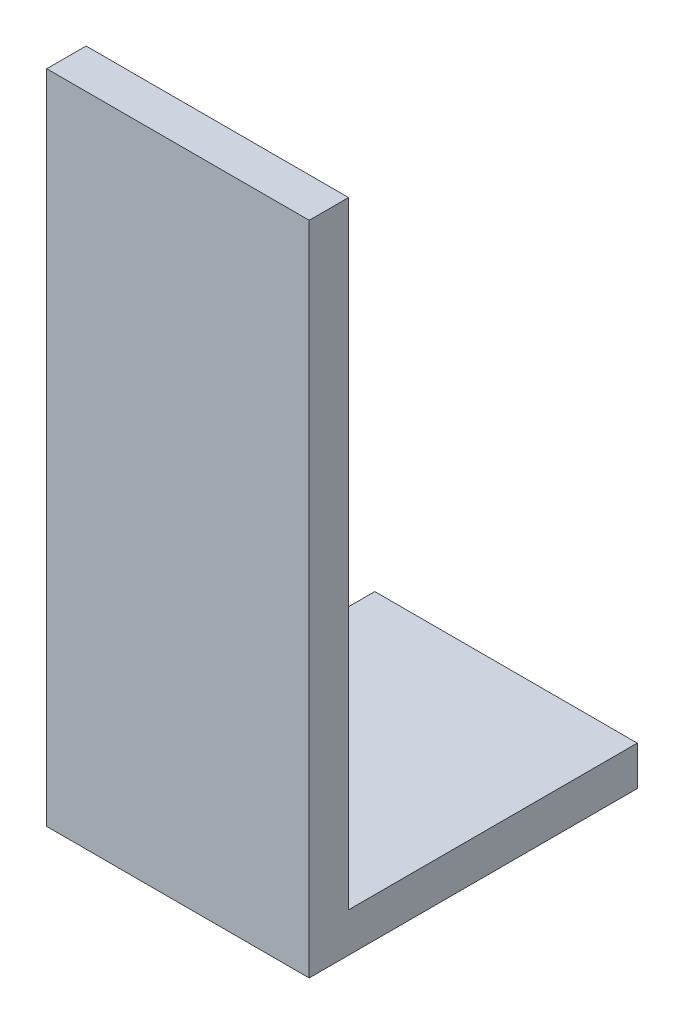
ISO-10303-21;
HEADER;
FILE_DESCRIPTION(('STEP AP214'),'2;1');
FILE_NAME('part.step','',(''),(''),'','','');
FILE_SCHEMA(('AUTOMOTIVE_DESIGN { 1 0 10303 214 1 1 1 1 }'));
ENDSEC;
DATA;
#1=APPLICATION_CONTEXT('core data for automotive mechanical design processes');
#2=APPLICATION_PROTOCOL_DEFINITION('international standard','automotive_design',2000,#1);
#3=PRODUCT_CONTEXT('',#1,'mechanical');
#4=PRODUCT('Part','Part','',(#3));
#5=PRODUCT_RELATED_PRODUCT_CATEGORY('part','',(#4));
#6=PRODUCT_DEFINITION_FORMATION('','',#4);
#7=PRODUCT_DEFINITION_CONTEXT('part definition',#1,'design');
#8=PRODUCT_DEFINITION('design','',#6,#7);
#9=PRODUCT_DEFINITION_SHAPE('','',#8);
#10=(LENGTH_UNIT() NAMED_UNIT(*) SI_UNIT(.MILLI.,.METRE.));
#11=(NAMED_UNIT(*) PLANE_ANGLE_UNIT() SI_UNIT($,.RADIAN.));
#12=(NAMED_UNIT(*) SI_UNIT($,.STERADIAN.) SOLID_ANGLE_UNIT());
#13=UNCERTAINTY_MEASURE_WITH_UNIT(LENGTH_MEASURE(1.E-05),#10,'distance_accuracy_value','');
#14=(GEOMETRIC_REPRESENTATION_CONTEXT(3) GLOBAL_UNCERTAINTY_ASSIGNED_CONTEXT((#13)) GLOBAL_UNIT_ASSIGNED_CONTEXT((#10,
#11,#12)) REPRESENTATION_CONTEXT('',''));
#15=CARTESIAN_POINT('',(0.,0.,0.));
#16=DIRECTION('',(0.,0.,1.));
#17=DIRECTION('',(1.,0.,0.));
#18=AXIS2_PLACEMENT_3D('',#15,#16,#17);
#19=CARTESIAN_POINT('',(20.,0.,0.));
#20=DIRECTION('',(0.,0.,-1.));
#21=DIRECTION('',(0.,1.,0.));
#22=AXIS2_PLACEMENT_3D('',#19,#20,#21);
#23=PLANE('',#22);
#24=DIRECTION('',(0.,-1.,0.));
#25=VECTOR('',#24,1.);
#26=CARTESIAN_POINT('',(0.,0.,0.));
#27=LINE('',#26,#25);
#28=CARTESIAN_POINT('',(0.,50.,0.));
#29=VERTEX_POINT('',#28);
#30=CARTESIAN_POINT('',(0.,0.,0.));
#31=VERTEX_POINT('',#30);
#32=EDGE_CURVE('E121',#29,#31,#27,.T.);
#33=ORIENTED_EDGE('',*,*,#32,.T.);
#34=DIRECTION('',(-1.,0.,0.));
#35=VECTOR('',#34,1.);
#36=CARTESIAN_POINT('',(20.,0.,0.));
#37=LINE('',#36,#35);
#38=CARTESIAN_POINT('',(20.,0.,0.));
#39=VERTEX_POINT('',#38);
#40=EDGE_CURVE('E11',#39,#31,#37,.T.);
#41=ORIENTED_EDGE('',*,*,#40,.F.);
#42=DIRECTION('',(0.,-1.,0.));
#43=VECTOR('',#42,1.);
#44=CARTESIAN_POINT('',(20.,0.,0.));
#45=LINE('',#44,#43);
#46=CARTESIAN_POINT('',(20.,50.,0.));
#47=VERTEX_POINT('',#46);
#48=EDGE_CURVE('E134',#47,#39,#45,.T.);
#49=ORIENTED_EDGE('',*,*,#48,.F.);
#50=DIRECTION('',(-1.,0.,0.));
#51=VECTOR('',#50,1.);
#52=CARTESIAN_POINT('',(20.,50.,0.));
#53=LINE('',#52,#51);
#54=EDGE_CURVE('E53',#47,#29,#53,.T.);
#55=ORIENTED_EDGE('',*,*,#54,.T.);
#56=EDGE_LOOP('',(#33,#41,#49,#55));
#57=FACE_BOUND('',#56,.T.);
#58=ADVANCED_FACE('F37',(#57),#23,.F.);
#59=CARTESIAN_POINT('',(20.,0.,0.));
#60=DIRECTION('',(0.,1.,0.));
#61=DIRECTION('',(0.,0.,1.));
#62=AXIS2_PLACEMENT_3D('',#59,#60,#61);
#63=PLANE('',#62);
#64=DIRECTION('',(0.,0.,-1.));
#65=VECTOR('',#64,1.);
#66=CARTESIAN_POINT('',(0.,0.,0.));
#67=LINE('',#66,#65);
#68=CARTESIAN_POINT('',(0.,0.,-25.));
#69=VERTEX_POINT('',#68);
#70=EDGE_CURVE('E123',#31,#69,#67,.T.);
#71=ORIENTED_EDGE('',*,*,#70,.T.);
#72=DIRECTION('',(-1.,0.,0.));
#73=VECTOR('',#72,1.);
#74=CARTESIAN_POINT('',(20.,0.,-25.));
#75=LINE('',#74,#73);
#76=CARTESIAN_POINT('',(20.,0.,-25.));
#77=VERTEX_POINT('',#76);
#78=EDGE_CURVE('E45',#77,#69,#75,.T.);
#79=ORIENTED_EDGE('',*,*,#78,.F.);
#80=DIRECTION('',(0.,0.,-1.));
#81=VECTOR('',#80,1.);
#82=CARTESIAN_POINT('',(20.,0.,0.));
#83=LINE('',#82,#81);
#84=EDGE_CURVE('E85',#39,#77,#83,.T.);
#85=ORIENTED_EDGE('',*,*,#84,.F.);
#86=ORIENTED_EDGE('',*,*,#40,.T.);
#87=EDGE_LOOP('',(#71,#79,#85,#86));
#88=FACE_BOUND('',#87,.T.);
#89=ADVANCED_FACE('F154',(#88),#63,.F.);
#90=CARTESIAN_POINT('',(20.,0.,-25.));
#91=DIRECTION('',(0.,0.,1.));
#92=DIRECTION('',(1.,0.,0.));
#93=AXIS2_PLACEMENT_3D('',#90,#91,#92);
#94=PLANE('',#93);
#95=DIRECTION('',(0.,1.,0.));
#96=VECTOR('',#95,1.);
#97=CARTESIAN_POINT('',(0.,0.,-25.));
#98=LINE('',#97,#96);
#99=CARTESIAN_POINT('',(0.,3.,-25.));
#100=VERTEX_POINT('',#99);
#101=EDGE_CURVE('E125',#69,#100,#98,.T.);
#102=ORIENTED_EDGE('',*,*,#101,.T.);
#103=DIRECTION('',(-1.,0.,0.));
#104=VECTOR('',#103,1.);
#105=CARTESIAN_POINT('',(20.,3.,-25.));
#106=LINE('',#105,#104);
#107=CARTESIAN_POINT('',(20.,3.,-25.));
#108=VERTEX_POINT('',#107);
#109=EDGE_CURVE('E104',#108,#100,#106,.T.);
#110=ORIENTED_EDGE('',*,*,#109,.F.);
#111=DIRECTION('',(0.,1.,0.));
#112=VECTOR('',#111,1.);
#113=CARTESIAN_POINT('',(20.,0.,-25.));
#114=LINE('',#113,#112);
#115=EDGE_CURVE('E112',#77,#108,#114,.T.);
#116=ORIENTED_EDGE('',*,*,#115,.F.);
#117=ORIENTED_EDGE('',*,*,#78,.T.);
#118=EDGE_LOOP('',(#102,#110,#116,#117));
#119=FACE_BOUND('',#118,.T.);
#120=ADVANCED_FACE('F140',(#119),#94,.F.);
#121=CARTESIAN_POINT('',(20.,3.,0.));
#122=DIRECTION('',(0.,1.,0.));
#123=DIRECTION('',(0.,0.,1.));
#124=AXIS2_PLACEMENT_3D('',#121,#122,#123);
#125=PLANE('',#124);
#126=DIRECTION('',(0.,0.,-1.));
#127=VECTOR('',#126,1.);
#128=CARTESIAN_POINT('',(0.,3.,0.));
#129=LINE('',#128,#127);
#130=CARTESIAN_POINT('',(0.,3.,-3.));
#131=VERTEX_POINT('',#130);
#132=EDGE_CURVE('E100',#131,#100,#129,.T.);
#133=ORIENTED_EDGE('',*,*,#132,.F.);
#134=DIRECTION('',(-1.,0.,0.));
#135=VECTOR('',#134,1.);
#136=CARTESIAN_POINT('',(20.,3.,-3.));
#137=LINE('',#136,#135);
#138=CARTESIAN_POINT('',(20.,3.,-3.));
#139=VERTEX_POINT('',#138);
#140=EDGE_CURVE('E95',#139,#131,#137,.T.);
#141=ORIENTED_EDGE('',*,*,#140,.F.);
#142=DIRECTION('',(0.,0.,-1.));
#143=VECTOR('',#142,1.);
#144=CARTESIAN_POINT('',(20.,3.,0.));
#145=LINE('',#144,#143);
#146=EDGE_CURVE('E98',#139,#108,#145,.T.);
#147=ORIENTED_EDGE('',*,*,#146,.T.);
#148=ORIENTED_EDGE('',*,*,#109,.T.);
#149=EDGE_LOOP('',(#133,#141,#147,#148));
#150=FACE_BOUND('',#149,.T.);
#151=ADVANCED_FACE('F97',(#150),#125,.T.);
#152=CARTESIAN_POINT('',(20.,0.,-3.00000000000001));
#153=DIRECTION('',(0.,0.,-1.));
#154=DIRECTION('',(0.,1.,0.));
#155=AXIS2_PLACEMENT_3D('',#152,#153,#154);
#156=PLANE('',#155);
#157=DIRECTION('',(0.,-1.,0.));
#158=VECTOR('',#157,1.);
#159=CARTESIAN_POINT('',(0.,0.,-3.00000000000001));
#160=LINE('',#159,#158);
#161=CARTESIAN_POINT('',(0.,50.,-3.));
#162=VERTEX_POINT('',#161);
#163=EDGE_CURVE('E129',#162,#131,#160,.T.);
#164=ORIENTED_EDGE('',*,*,#163,.F.);
#165=DIRECTION('',(-1.,0.,0.));
#166=VECTOR('',#165,1.);
#167=CARTESIAN_POINT('',(20.,50.,-3.));
#168=LINE('',#167,#166);
#169=CARTESIAN_POINT('',(20.,50.,-3.));
#170=VERTEX_POINT('',#169);
#171=EDGE_CURVE('E73',#170,#162,#168,.T.);
#172=ORIENTED_EDGE('',*,*,#171,.F.);
#173=DIRECTION('',(0.,-1.,0.));
#174=VECTOR('',#173,1.);
#175=CARTESIAN_POINT('',(20.,0.,-3.00000000000001));
#176=LINE('',#175,#174);
#177=EDGE_CURVE('E110',#170,#139,#176,.T.);
#178=ORIENTED_EDGE('',*,*,#177,.T.);
#179=ORIENTED_EDGE('',*,*,#140,.T.);
#180=EDGE_LOOP('',(#164,#172,#178,#179));
#181=FACE_BOUND('',#180,.T.);
#182=ADVANCED_FACE('F115',(#181),#156,.T.);
#183=CARTESIAN_POINT('',(20.,50.,0.));
#184=DIRECTION('',(0.,1.,0.));
#185=DIRECTION('',(0.,0.,1.));
#186=AXIS2_PLACEMENT_3D('',#183,#184,#185);
#187=PLANE('',#186);
#188=DIRECTION('',(0.,0.,-1.));
#189=VECTOR('',#188,1.);
#190=CARTESIAN_POINT('',(0.,50.,0.));
#191=LINE('',#190,#189);
#192=EDGE_CURVE('E131',#29,#162,#191,.T.);
#193=ORIENTED_EDGE('',*,*,#192,.F.);
#194=ORIENTED_EDGE('',*,*,#54,.F.);
#195=DIRECTION('',(0.,0.,-1.));
#196=VECTOR('',#195,1.);
#197=CARTESIAN_POINT('',(20.,50.,0.));
#198=LINE('',#197,#196);
#199=EDGE_CURVE('E116',#47,#170,#198,.T.);
#200=ORIENTED_EDGE('',*,*,#199,.T.);
#201=ORIENTED_EDGE('',*,*,#171,.T.);
#202=EDGE_LOOP('',(#193,#194,#200,#201));
#203=FACE_BOUND('',#202,.T.);
#204=ADVANCED_FACE('F143',(#203),#187,.T.);
#205=CARTESIAN_POINT('',(20.,0.,0.));
#206=DIRECTION('',(1.,0.,0.));
#207=DIRECTION('',(0.,0.,-1.));
#208=AXIS2_PLACEMENT_3D('',#205,#206,#207);
#209=PLANE('',#208);
#210=ORIENTED_EDGE('',*,*,#48,.T.);
#211=ORIENTED_EDGE('',*,*,#84,.T.);
#212=ORIENTED_EDGE('',*,*,#115,.T.);
#213=ORIENTED_EDGE('',*,*,#146,.F.);
#214=ORIENTED_EDGE('',*,*,#177,.F.);
#215=ORIENTED_EDGE('',*,*,#199,.F.);
#216=EDGE_LOOP('',(#210,#211,#212,#213,#214,#215));
#217=FACE_BOUND('',#216,.T.);
#218=ADVANCED_FACE('F108',(#217),#209,.T.);
#219=CARTESIAN_POINT('',(0.,0.,0.));
#220=DIRECTION('',(1.,0.,0.));
#221=DIRECTION('',(0.,0.,-1.));
#222=AXIS2_PLACEMENT_3D('',#219,#220,#221);
#223=PLANE('',#222);
#224=ORIENTED_EDGE('',*,*,#32,.F.);
#225=ORIENTED_EDGE('',*,*,#192,.T.);
#226=ORIENTED_EDGE('',*,*,#163,.T.);
#227=ORIENTED_EDGE('',*,*,#132,.T.);
#228=ORIENTED_EDGE('',*,*,#101,.F.);
#229=ORIENTED_EDGE('',*,*,#70,.F.);
#230=EDGE_LOOP('',(#224,#225,#226,#227,#228,#229));
#231=FACE_BOUND('',#230,.T.);
#232=ADVANCED_FACE('F142',(#231),#223,.F.);
#233=CLOSED_SHELL('',(#58,#89,#120,#151,#182,#204,#218,#232));
#234=MANIFOLD_SOLID_BREP('B2',#233);
#235=ADVANCED_BREP_SHAPE_REPRESENTATION('',(#18,#234),#14);
#236=SHAPE_DEFINITION_REPRESENTATION(#9,#235);
ENDSEC;
END-ISO-10303-21;
